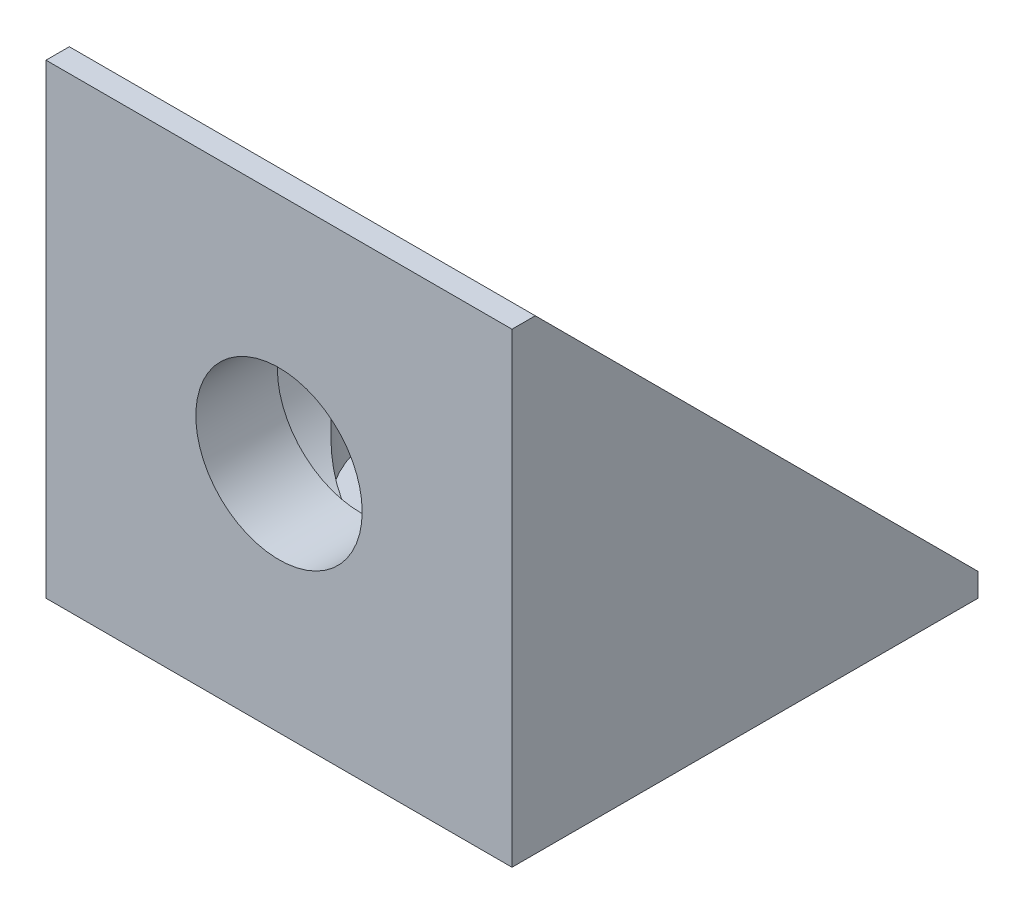
ISO-10303-21;
HEADER;
FILE_DESCRIPTION(('STEP AP214'),'2;1');
FILE_NAME('part.step','',(''),(''),'','','');
FILE_SCHEMA(('AUTOMOTIVE_DESIGN { 1 0 10303 214 1 1 1 1 }'));
ENDSEC;
DATA;
#1=APPLICATION_CONTEXT('core data for automotive mechanical design processes');
#2=APPLICATION_PROTOCOL_DEFINITION('international standard','automotive_design',2000,#1);
#3=PRODUCT_CONTEXT('',#1,'mechanical');
#4=PRODUCT('Part','Part','',(#3));
#5=PRODUCT_RELATED_PRODUCT_CATEGORY('part','',(#4));
#6=PRODUCT_DEFINITION_FORMATION('','',#4);
#7=PRODUCT_DEFINITION_CONTEXT('part definition',#1,'design');
#8=PRODUCT_DEFINITION('design','',#6,#7);
#9=PRODUCT_DEFINITION_SHAPE('','',#8);
#10=(LENGTH_UNIT() NAMED_UNIT(*) SI_UNIT(.MILLI.,.METRE.));
#11=(NAMED_UNIT(*) PLANE_ANGLE_UNIT() SI_UNIT($,.RADIAN.));
#12=(NAMED_UNIT(*) SI_UNIT($,.STERADIAN.) SOLID_ANGLE_UNIT());
#13=UNCERTAINTY_MEASURE_WITH_UNIT(LENGTH_MEASURE(1.E-05),#10,'distance_accuracy_value','');
#14=(GEOMETRIC_REPRESENTATION_CONTEXT(3) GLOBAL_UNCERTAINTY_ASSIGNED_CONTEXT((#13)) GLOBAL_UNIT_ASSIGNED_CONTEXT((#10,
#11,#12)) REPRESENTATION_CONTEXT('',''));
#15=CARTESIAN_POINT('',(0.,0.,0.));
#16=DIRECTION('',(0.,0.,1.));
#17=DIRECTION('',(1.,0.,0.));
#18=AXIS2_PLACEMENT_3D('',#15,#16,#17);
#19=CARTESIAN_POINT('',(0.,-15.556349186104,-10.));
#20=DIRECTION('',(0.,1.,0.));
#21=DIRECTION('',(0.,0.,1.));
#22=AXIS2_PLACEMENT_3D('',#19,#20,#21);
#23=CYLINDRICAL_SURFACE('',#22,5.5);
#24=CARTESIAN_POINT('',(0.,9.99999999999997,-10.));
#25=DIRECTION('',(0.,0.707106781186547,-0.707106781186547));
#26=DIRECTION('',(0.,0.707106781186547,0.707106781186547));
#27=AXIS2_PLACEMENT_3D('',#24,#25,#26);
#28=ELLIPSE('',#27,7.77817459305202,5.5);
#29=CARTESIAN_POINT('',(5.5,9.99999999999997,-10.));
#30=VERTEX_POINT('',#29);
#31=CARTESIAN_POINT('',(-5.5,9.99999999999997,-10.));
#32=VERTEX_POINT('',#31);
#33=EDGE_CURVE('E41',#30,#32,#28,.F.);
#34=ORIENTED_EDGE('',*,*,#33,.T.);
#35=CARTESIAN_POINT('',(0.,9.99999999999997,-10.));
#36=DIRECTION('',(0.,0.707106781186547,0.707106781186547));
#37=DIRECTION('',(0.,0.707106781186547,-0.707106781186547));
#38=AXIS2_PLACEMENT_3D('',#35,#36,#37);
#39=ELLIPSE('',#38,7.77817459305202,5.5);
#40=CARTESIAN_POINT('',(-5.47722557505166,10.4999999999998,-10.5000000000002));
#41=VERTEX_POINT('',#40);
#42=EDGE_CURVE('E12',#32,#41,#39,.F.);
#43=ORIENTED_EDGE('',*,*,#42,.T.);
#44=CARTESIAN_POINT('',(0.,11.,-10.));
#45=DIRECTION('',(0.,-0.707106781186552,0.707106781186543));
#46=DIRECTION('',(0.,0.707106781186543,0.707106781186552));
#47=AXIS2_PLACEMENT_3D('',#44,#45,#46);
#48=ELLIPSE('',#47,7.77817459305198,5.5);
#49=CARTESIAN_POINT('',(5.47722557505166,10.5,-10.5));
#50=VERTEX_POINT('',#49);
#51=EDGE_CURVE('E145',#50,#41,#48,.T.);
#52=ORIENTED_EDGE('',*,*,#51,.F.);
#53=EDGE_CURVE('E47',#50,#30,#39,.F.);
#54=ORIENTED_EDGE('',*,*,#53,.T.);
#55=EDGE_LOOP('',(#34,#43,#52,#54));
#56=FACE_BOUND('',#55,.T.);
#57=ADVANCED_FACE('F37',(#56),#23,.F.);
#58=CARTESIAN_POINT('',(0.,9.99999999999997,-20.));
#59=DIRECTION('',(0.,0.,1.));
#60=DIRECTION('',(1.,0.,0.));
#61=AXIS2_PLACEMENT_3D('',#58,#59,#60);
#62=CYLINDRICAL_SURFACE('',#61,3.57);
#63=CARTESIAN_POINT('',(0.,9.99999999999997,0.));
#64=DIRECTION('',(0.,0.,1.));
#65=DIRECTION('',(1.,0.,0.));
#66=AXIS2_PLACEMENT_3D('',#63,#64,#65);
#67=CIRCLE('',#66,3.57);
#68=CARTESIAN_POINT('',(3.57,9.99999999999997,0.));
#69=VERTEX_POINT('',#68);
#70=EDGE_CURVE('E216',#69,#69,#67,.T.);
#71=ORIENTED_EDGE('',*,*,#70,.T.);
#72=EDGE_LOOP('',(#71));
#73=FACE_BOUND('',#72,.T.);
#74=CARTESIAN_POINT('',(0.,9.99999999999997,-3.5));
#75=DIRECTION('',(0.,0.,-1.));
#76=DIRECTION('',(-1.,0.,0.));
#77=AXIS2_PLACEMENT_3D('',#74,#75,#76);
#78=CIRCLE('',#77,3.57);
#79=CARTESIAN_POINT('',(-3.57,9.99999999999997,-3.5));
#80=VERTEX_POINT('',#79);
#81=EDGE_CURVE('E149',#80,#80,#78,.F.);
#82=ORIENTED_EDGE('',*,*,#81,.F.);
#83=EDGE_LOOP('',(#82));
#84=FACE_BOUND('',#83,.T.);
#85=ADVANCED_FACE('F184',(#73,#84),#62,.F.);
#86=CARTESIAN_POINT('',(0.,19.9999999999999,-10.));
#87=DIRECTION('',(0.,-1.,0.));
#88=DIRECTION('',(0.,0.,-1.));
#89=AXIS2_PLACEMENT_3D('',#86,#87,#88);
#90=CYLINDRICAL_SURFACE('',#89,3.57);
#91=CARTESIAN_POINT('',(0.,0.,-10.));
#92=DIRECTION('',(0.,-1.,0.));
#93=DIRECTION('',(0.,0.,-1.));
#94=AXIS2_PLACEMENT_3D('',#91,#92,#93);
#95=CIRCLE('',#94,3.57);
#96=CARTESIAN_POINT('',(0.,0.,-13.57));
#97=VERTEX_POINT('',#96);
#98=EDGE_CURVE('E130',#97,#97,#95,.T.);
#99=ORIENTED_EDGE('',*,*,#98,.T.);
#100=EDGE_LOOP('',(#99));
#101=FACE_BOUND('',#100,.T.);
#102=CARTESIAN_POINT('',(0.,3.5,-10.));
#103=DIRECTION('',(0.,1.,0.));
#104=DIRECTION('',(0.,0.,1.));
#105=AXIS2_PLACEMENT_3D('',#102,#103,#104);
#106=CIRCLE('',#105,3.57);
#107=CARTESIAN_POINT('',(0.,3.5,-6.43));
#108=VERTEX_POINT('',#107);
#109=EDGE_CURVE('E142',#108,#108,#106,.F.);
#110=ORIENTED_EDGE('',*,*,#109,.F.);
#111=EDGE_LOOP('',(#110));
#112=FACE_BOUND('',#111,.T.);
#113=ADVANCED_FACE('F188',(#101,#112),#90,.F.);
#114=CARTESIAN_POINT('',(10.,1.00000000000015,-20.));
#115=DIRECTION('',(0.,0.,1.));
#116=DIRECTION('',(1.,0.,0.));
#117=AXIS2_PLACEMENT_3D('',#114,#115,#116);
#118=PLANE('',#117);
#119=DIRECTION('',(0.,1.,0.));
#120=VECTOR('',#119,1.);
#121=CARTESIAN_POINT('',(-10.,1.00000000000015,-20.));
#122=LINE('',#121,#120);
#123=CARTESIAN_POINT('',(-10.,0.,-20.));
#124=VERTEX_POINT('',#123);
#125=CARTESIAN_POINT('',(-10.,1.00000000000015,-20.));
#126=VERTEX_POINT('',#125);
#127=EDGE_CURVE('E126',#124,#126,#122,.T.);
#128=ORIENTED_EDGE('',*,*,#127,.T.);
#129=DIRECTION('',(-1.,0.,0.));
#130=VECTOR('',#129,1.);
#131=CARTESIAN_POINT('',(10.,1.00000000000015,-20.));
#132=LINE('',#131,#130);
#133=CARTESIAN_POINT('',(10.,1.00000000000015,-20.));
#134=VERTEX_POINT('',#133);
#135=EDGE_CURVE('E140',#134,#126,#132,.T.);
#136=ORIENTED_EDGE('',*,*,#135,.F.);
#137=DIRECTION('',(0.,1.,0.));
#138=VECTOR('',#137,1.);
#139=CARTESIAN_POINT('',(10.,1.00000000000015,-20.));
#140=LINE('',#139,#138);
#141=CARTESIAN_POINT('',(10.,0.,-20.));
#142=VERTEX_POINT('',#141);
#143=EDGE_CURVE('E136',#142,#134,#140,.T.);
#144=ORIENTED_EDGE('',*,*,#143,.F.);
#145=DIRECTION('',(-1.,0.,0.));
#146=VECTOR('',#145,1.);
#147=CARTESIAN_POINT('',(10.,0.,-20.));
#148=LINE('',#147,#146);
#149=EDGE_CURVE('E122',#142,#124,#148,.T.);
#150=ORIENTED_EDGE('',*,*,#149,.T.);
#151=EDGE_LOOP('',(#128,#136,#144,#150));
#152=FACE_BOUND('',#151,.T.);
#153=ADVANCED_FACE('F39',(#152),#118,.F.);
#154=CARTESIAN_POINT('',(10.,19.9999999999999,-1.));
#155=DIRECTION('',(0.,-0.707106781186552,0.707106781186543));
#156=DIRECTION('',(0.,-0.707106781186543,-0.707106781186552));
#157=AXIS2_PLACEMENT_3D('',#154,#155,#156);
#158=PLANE('',#157);
#159=ORIENTED_EDGE('',*,*,#51,.T.);
#160=CARTESIAN_POINT('',(0.,9.99999999999997,-11.0000000000001));
#161=DIRECTION('',(0.,-0.707106781186552,0.707106781186543));
#162=DIRECTION('',(0.,-0.707106781186543,-0.707106781186552));
#163=AXIS2_PLACEMENT_3D('',#160,#161,#162);
#164=ELLIPSE('',#163,7.77817459305207,5.5);
#165=EDGE_CURVE('E151',#41,#50,#164,.T.);
#166=ORIENTED_EDGE('',*,*,#165,.T.);
#167=EDGE_LOOP('',(#159,#166));
#168=FACE_BOUND('',#167,.T.);
#169=DIRECTION('',(0.,0.707106781186543,0.707106781186552));
#170=VECTOR('',#169,1.);
#171=CARTESIAN_POINT('',(-10.,19.9999999999999,-1.));
#172=LINE('',#171,#170);
#173=CARTESIAN_POINT('',(-10.,19.9999999999999,-1.));
#174=VERTEX_POINT('',#173);
#175=EDGE_CURVE('E129',#126,#174,#172,.T.);
#176=ORIENTED_EDGE('',*,*,#175,.T.);
#177=DIRECTION('',(-1.,0.,0.));
#178=VECTOR('',#177,1.);
#179=CARTESIAN_POINT('',(10.,19.9999999999999,-1.));
#180=LINE('',#179,#178);
#181=CARTESIAN_POINT('',(10.,19.9999999999999,-1.));
#182=VERTEX_POINT('',#181);
#183=EDGE_CURVE('E117',#182,#174,#180,.T.);
#184=ORIENTED_EDGE('',*,*,#183,.F.);
#185=DIRECTION('',(0.,0.707106781186543,0.707106781186552));
#186=VECTOR('',#185,1.);
#187=CARTESIAN_POINT('',(10.,19.9999999999999,-1.));
#188=LINE('',#187,#186);
#189=EDGE_CURVE('E95',#134,#182,#188,.T.);
#190=ORIENTED_EDGE('',*,*,#189,.F.);
#191=ORIENTED_EDGE('',*,*,#135,.T.);
#192=EDGE_LOOP('',(#176,#184,#190,#191));
#193=FACE_BOUND('',#192,.T.);
#194=ADVANCED_FACE('F225',(#168,#193),#158,.F.);
#195=CARTESIAN_POINT('',(10.,19.9999999999999,0.));
#196=DIRECTION('',(0.,-1.,0.));
#197=DIRECTION('',(0.,0.,-1.));
#198=AXIS2_PLACEMENT_3D('',#195,#196,#197);
#199=PLANE('',#198);
#200=DIRECTION('',(0.,0.,1.));
#201=VECTOR('',#200,1.);
#202=CARTESIAN_POINT('',(-10.,19.9999999999999,0.));
#203=LINE('',#202,#201);
#204=CARTESIAN_POINT('',(-10.,19.9999999999999,0.));
#205=VERTEX_POINT('',#204);
#206=EDGE_CURVE('E114',#174,#205,#203,.T.);
#207=ORIENTED_EDGE('',*,*,#206,.T.);
#208=DIRECTION('',(-1.,0.,0.));
#209=VECTOR('',#208,1.);
#210=CARTESIAN_POINT('',(10.,19.9999999999999,0.));
#211=LINE('',#210,#209);
#212=CARTESIAN_POINT('',(10.,19.9999999999999,0.));
#213=VERTEX_POINT('',#212);
#214=EDGE_CURVE('E111',#213,#205,#211,.T.);
#215=ORIENTED_EDGE('',*,*,#214,.F.);
#216=DIRECTION('',(0.,0.,1.));
#217=VECTOR('',#216,1.);
#218=CARTESIAN_POINT('',(10.,19.9999999999999,0.));
#219=LINE('',#218,#217);
#220=EDGE_CURVE('E101',#182,#213,#219,.T.);
#221=ORIENTED_EDGE('',*,*,#220,.F.);
#222=ORIENTED_EDGE('',*,*,#183,.T.);
#223=EDGE_LOOP('',(#207,#215,#221,#222));
#224=FACE_BOUND('',#223,.T.);
#225=ADVANCED_FACE('F112',(#224),#199,.F.);
#226=CARTESIAN_POINT('',(10.,0.,0.));
#227=DIRECTION('',(0.,0.,-1.));
#228=DIRECTION('',(-1.,0.,0.));
#229=AXIS2_PLACEMENT_3D('',#226,#227,#228);
#230=PLANE('',#229);
#231=ORIENTED_EDGE('',*,*,#70,.F.);
#232=EDGE_LOOP('',(#231));
#233=FACE_BOUND('',#232,.T.);
#234=DIRECTION('',(0.,-1.,0.));
#235=VECTOR('',#234,1.);
#236=CARTESIAN_POINT('',(-10.,0.,0.));
#237=LINE('',#236,#235);
#238=CARTESIAN_POINT('',(-10.,0.,0.));
#239=VERTEX_POINT('',#238);
#240=EDGE_CURVE('E133',#205,#239,#237,.T.);
#241=ORIENTED_EDGE('',*,*,#240,.T.);
#242=DIRECTION('',(-1.,0.,0.));
#243=VECTOR('',#242,1.);
#244=CARTESIAN_POINT('',(10.,0.,0.));
#245=LINE('',#244,#243);
#246=CARTESIAN_POINT('',(10.,0.,0.));
#247=VERTEX_POINT('',#246);
#248=EDGE_CURVE('E118',#247,#239,#245,.T.);
#249=ORIENTED_EDGE('',*,*,#248,.F.);
#250=DIRECTION('',(0.,-1.,0.));
#251=VECTOR('',#250,1.);
#252=CARTESIAN_POINT('',(10.,0.,0.));
#253=LINE('',#252,#251);
#254=EDGE_CURVE('E105',#213,#247,#253,.T.);
#255=ORIENTED_EDGE('',*,*,#254,.F.);
#256=ORIENTED_EDGE('',*,*,#214,.T.);
#257=EDGE_LOOP('',(#241,#249,#255,#256));
#258=FACE_BOUND('',#257,.T.);
#259=ADVANCED_FACE('F120',(#233,#258),#230,.F.);
#260=CARTESIAN_POINT('',(10.,0.,-20.));
#261=DIRECTION('',(0.,1.,0.));
#262=DIRECTION('',(0.,0.,1.));
#263=AXIS2_PLACEMENT_3D('',#260,#261,#262);
#264=PLANE('',#263);
#265=ORIENTED_EDGE('',*,*,#98,.F.);
#266=EDGE_LOOP('',(#265));
#267=FACE_BOUND('',#266,.T.);
#268=DIRECTION('',(0.,0.,-1.));
#269=VECTOR('',#268,1.);
#270=CARTESIAN_POINT('',(-10.,0.,-20.));
#271=LINE('',#270,#269);
#272=EDGE_CURVE('E86',#239,#124,#271,.T.);
#273=ORIENTED_EDGE('',*,*,#272,.T.);
#274=ORIENTED_EDGE('',*,*,#149,.F.);
#275=DIRECTION('',(0.,0.,-1.));
#276=VECTOR('',#275,1.);
#277=CARTESIAN_POINT('',(10.,0.,-20.));
#278=LINE('',#277,#276);
#279=EDGE_CURVE('E62',#247,#142,#278,.T.);
#280=ORIENTED_EDGE('',*,*,#279,.F.);
#281=ORIENTED_EDGE('',*,*,#248,.T.);
#282=EDGE_LOOP('',(#273,#274,#280,#281));
#283=FACE_BOUND('',#282,.T.);
#284=ADVANCED_FACE('F226',(#267,#283),#264,.F.);
#285=CARTESIAN_POINT('',(10.,0.,-20.));
#286=DIRECTION('',(-1.,0.,0.));
#287=DIRECTION('',(0.,0.,1.));
#288=AXIS2_PLACEMENT_3D('',#285,#286,#287);
#289=PLANE('',#288);
#290=ORIENTED_EDGE('',*,*,#143,.T.);
#291=ORIENTED_EDGE('',*,*,#189,.T.);
#292=ORIENTED_EDGE('',*,*,#220,.T.);
#293=ORIENTED_EDGE('',*,*,#254,.T.);
#294=ORIENTED_EDGE('',*,*,#279,.T.);
#295=EDGE_LOOP('',(#290,#291,#292,#293,#294));
#296=FACE_BOUND('',#295,.T.);
#297=ADVANCED_FACE('F103',(#296),#289,.F.);
#298=CARTESIAN_POINT('',(-10.,0.,-20.));
#299=DIRECTION('',(-1.,0.,0.));
#300=DIRECTION('',(0.,0.,1.));
#301=AXIS2_PLACEMENT_3D('',#298,#299,#300);
#302=PLANE('',#301);
#303=ORIENTED_EDGE('',*,*,#127,.F.);
#304=ORIENTED_EDGE('',*,*,#272,.F.);
#305=ORIENTED_EDGE('',*,*,#240,.F.);
#306=ORIENTED_EDGE('',*,*,#206,.F.);
#307=ORIENTED_EDGE('',*,*,#175,.F.);
#308=EDGE_LOOP('',(#303,#304,#305,#306,#307));
#309=FACE_BOUND('',#308,.T.);
#310=ADVANCED_FACE('F169',(#309),#302,.T.);
#311=CARTESIAN_POINT('',(0.,3.5,-10.));
#312=DIRECTION('',(0.,1.,0.));
#313=DIRECTION('',(0.,0.,1.));
#314=AXIS2_PLACEMENT_3D('',#311,#312,#313);
#315=CIRCLE('',#314,5.5);
#316=CARTESIAN_POINT('',(0.,3.5,-4.5));
#317=VERTEX_POINT('',#316);
#318=EDGE_CURVE('E146',#317,#317,#315,.F.);
#319=ORIENTED_EDGE('',*,*,#318,.T.);
#320=EDGE_LOOP('',(#319));
#321=FACE_BOUND('',#320,.T.);
#322=CARTESIAN_POINT('',(0.,9.99999999999997,-10.));
#323=DIRECTION('',(0.,0.707106781186547,0.707106781186547));
#324=DIRECTION('',(0.,0.707106781186547,-0.707106781186547));
#325=AXIS2_PLACEMENT_3D('',#322,#323,#324);
#326=ELLIPSE('',#325,7.77817459305202,5.5);
#327=EDGE_CURVE('E154',#32,#30,#326,.T.);
#328=ORIENTED_EDGE('',*,*,#327,.T.);
#329=CARTESIAN_POINT('',(0.,9.99999999999997,-10.));
#330=DIRECTION('',(0.,0.707106781186547,-0.707106781186547));
#331=DIRECTION('',(0.,0.707106781186547,0.707106781186547));
#332=AXIS2_PLACEMENT_3D('',#329,#330,#331);
#333=ELLIPSE('',#332,7.77817459305202,5.5);
#334=EDGE_CURVE('E156',#30,#32,#333,.T.);
#335=ORIENTED_EDGE('',*,*,#334,.T.);
#336=EDGE_LOOP('',(#328,#335));
#337=FACE_BOUND('',#336,.T.);
#338=ADVANCED_FACE('F166',(#321,#337),#23,.F.);
#339=CARTESIAN_POINT('',(10.,3.5,-20.));
#340=DIRECTION('',(0.,1.,0.));
#341=DIRECTION('',(0.,0.,1.));
#342=AXIS2_PLACEMENT_3D('',#339,#340,#341);
#343=PLANE('',#342);
#344=ORIENTED_EDGE('',*,*,#318,.F.);
#345=EDGE_LOOP('',(#344));
#346=FACE_BOUND('',#345,.T.);
#347=ORIENTED_EDGE('',*,*,#109,.T.);
#348=EDGE_LOOP('',(#347));
#349=FACE_BOUND('',#348,.T.);
#350=ADVANCED_FACE('F168',(#346,#349),#343,.T.);
#351=CARTESIAN_POINT('',(10.,0.,-3.5));
#352=DIRECTION('',(0.,0.,-1.));
#353=DIRECTION('',(-1.,0.,0.));
#354=AXIS2_PLACEMENT_3D('',#351,#352,#353);
#355=PLANE('',#354);
#356=CARTESIAN_POINT('',(0.,9.99999999999997,-3.5));
#357=DIRECTION('',(0.,0.,-1.));
#358=DIRECTION('',(-1.,0.,0.));
#359=AXIS2_PLACEMENT_3D('',#356,#357,#358);
#360=CIRCLE('',#359,5.5);
#361=CARTESIAN_POINT('',(-5.5,9.99999999999997,-3.5));
#362=VERTEX_POINT('',#361);
#363=EDGE_CURVE('E152',#362,#362,#360,.F.);
#364=ORIENTED_EDGE('',*,*,#363,.F.);
#365=EDGE_LOOP('',(#364));
#366=FACE_BOUND('',#365,.T.);
#367=ORIENTED_EDGE('',*,*,#81,.T.);
#368=EDGE_LOOP('',(#367));
#369=FACE_BOUND('',#368,.T.);
#370=ADVANCED_FACE('F176',(#366,#369),#355,.T.);
#371=CARTESIAN_POINT('',(0.,9.99999999999997,15.556349186104));
#372=DIRECTION('',(0.,0.,-1.));
#373=DIRECTION('',(-1.,0.,0.));
#374=AXIS2_PLACEMENT_3D('',#371,#372,#373);
#375=CYLINDRICAL_SURFACE('',#374,5.5);
#376=ORIENTED_EDGE('',*,*,#363,.T.);
#377=EDGE_LOOP('',(#376));
#378=FACE_BOUND('',#377,.T.);
#379=ORIENTED_EDGE('',*,*,#327,.F.);
#380=ORIENTED_EDGE('',*,*,#33,.F.);
#381=EDGE_LOOP('',(#379,#380));
#382=FACE_BOUND('',#381,.T.);
#383=ADVANCED_FACE('F165',(#378,#382),#375,.F.);
#384=ORIENTED_EDGE('',*,*,#334,.F.);
#385=ORIENTED_EDGE('',*,*,#53,.F.);
#386=ORIENTED_EDGE('',*,*,#165,.F.);
#387=ORIENTED_EDGE('',*,*,#42,.F.);
#388=EDGE_LOOP('',(#384,#385,#386,#387));
#389=FACE_BOUND('',#388,.T.);
#390=ADVANCED_FACE('F198',(#389),#375,.F.);
#391=CLOSED_SHELL('',(#57,#85,#113,#153,#194,#225,#259,#284,#297,#310,#338,#350,#370,#383,#390));
#392=MANIFOLD_SOLID_BREP('B2',#391);
#393=ADVANCED_BREP_SHAPE_REPRESENTATION('',(#18,#392),#14);
#394=SHAPE_DEFINITION_REPRESENTATION(#9,#393);
ENDSEC;
END-ISO-10303-21;
